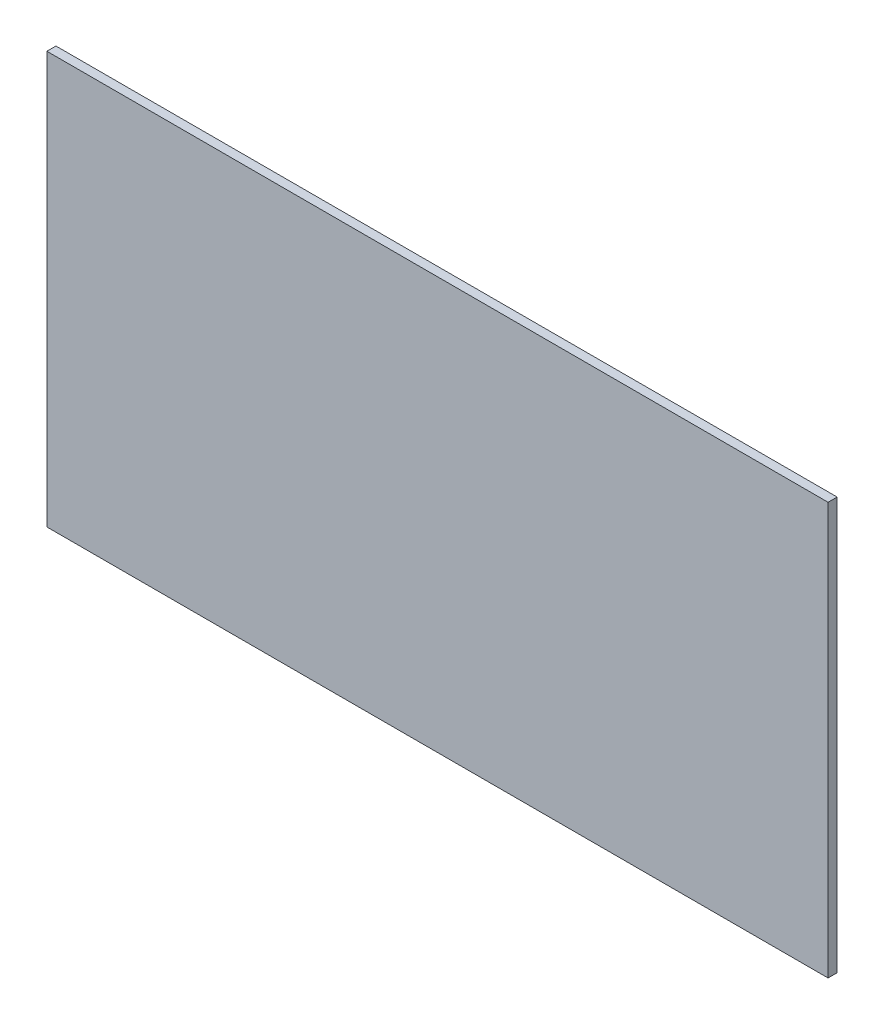
ISO-10303-21;
HEADER;
FILE_DESCRIPTION(('STEP AP214'),'2;1');
FILE_NAME('part.step','',(''),(''),'','','');
FILE_SCHEMA(('AUTOMOTIVE_DESIGN { 1 0 10303 214 1 1 1 1 }'));
ENDSEC;
DATA;
#1=APPLICATION_CONTEXT('core data for automotive mechanical design processes');
#2=APPLICATION_PROTOCOL_DEFINITION('international standard','automotive_design',2000,#1);
#3=PRODUCT_CONTEXT('',#1,'mechanical');
#4=PRODUCT('Part','Part','',(#3));
#5=PRODUCT_RELATED_PRODUCT_CATEGORY('part','',(#4));
#6=PRODUCT_DEFINITION_FORMATION('','',#4);
#7=PRODUCT_DEFINITION_CONTEXT('part definition',#1,'design');
#8=PRODUCT_DEFINITION('design','',#6,#7);
#9=PRODUCT_DEFINITION_SHAPE('','',#8);
#10=(LENGTH_UNIT() NAMED_UNIT(*) SI_UNIT(.MILLI.,.METRE.));
#11=(NAMED_UNIT(*) PLANE_ANGLE_UNIT() SI_UNIT($,.RADIAN.));
#12=(NAMED_UNIT(*) SI_UNIT($,.STERADIAN.) SOLID_ANGLE_UNIT());
#13=UNCERTAINTY_MEASURE_WITH_UNIT(LENGTH_MEASURE(1.E-05),#10,'distance_accuracy_value','');
#14=(GEOMETRIC_REPRESENTATION_CONTEXT(3) GLOBAL_UNCERTAINTY_ASSIGNED_CONTEXT((#13)) GLOBAL_UNIT_ASSIGNED_CONTEXT((#10,
#11,#12)) REPRESENTATION_CONTEXT('',''));
#15=CARTESIAN_POINT('',(0.,0.,0.));
#16=DIRECTION('',(0.,0.,1.));
#17=DIRECTION('',(1.,0.,0.));
#18=AXIS2_PLACEMENT_3D('',#15,#16,#17);
#19=CARTESIAN_POINT('',(0.,0.,-2.65684));
#20=DIRECTION('',(-1.,0.,0.));
#21=DIRECTION('',(0.,0.,1.));
#22=AXIS2_PLACEMENT_3D('',#19,#20,#21);
#23=PLANE('',#22);
#24=DIRECTION('',(0.,-1.,0.));
#25=VECTOR('',#24,1.);
#26=CARTESIAN_POINT('',(0.,0.,0.));
#27=LINE('',#26,#25);
#28=CARTESIAN_POINT('',(0.,120.88368,0.));
#29=VERTEX_POINT('',#28);
#30=CARTESIAN_POINT('',(0.,0.,0.));
#31=VERTEX_POINT('',#30);
#32=EDGE_CURVE('E102',#29,#31,#27,.T.);
#33=ORIENTED_EDGE('',*,*,#32,.F.);
#34=DIRECTION('',(0.,0.,1.));
#35=VECTOR('',#34,1.);
#36=CARTESIAN_POINT('',(0.,120.88368,-2.65684));
#37=LINE('',#36,#35);
#38=CARTESIAN_POINT('',(0.,120.88368,-2.65684));
#39=VERTEX_POINT('',#38);
#40=EDGE_CURVE('E11',#39,#29,#37,.T.);
#41=ORIENTED_EDGE('',*,*,#40,.F.);
#42=DIRECTION('',(0.,-1.,0.));
#43=VECTOR('',#42,1.);
#44=CARTESIAN_POINT('',(0.,0.,-2.65684));
#45=LINE('',#44,#43);
#46=CARTESIAN_POINT('',(0.,0.,-2.65684));
#47=VERTEX_POINT('',#46);
#48=EDGE_CURVE('E96',#39,#47,#45,.T.);
#49=ORIENTED_EDGE('',*,*,#48,.T.);
#50=DIRECTION('',(0.,0.,1.));
#51=VECTOR('',#50,1.);
#52=CARTESIAN_POINT('',(0.,0.,-2.65684));
#53=LINE('',#52,#51);
#54=EDGE_CURVE('E41',#47,#31,#53,.T.);
#55=ORIENTED_EDGE('',*,*,#54,.T.);
#56=EDGE_LOOP('',(#33,#41,#49,#55));
#57=FACE_BOUND('',#56,.T.);
#58=ADVANCED_FACE('F38',(#57),#23,.T.);
#59=CARTESIAN_POINT('',(0.,120.88368,-2.65684));
#60=DIRECTION('',(0.,1.,0.));
#61=DIRECTION('',(0.,0.,1.));
#62=AXIS2_PLACEMENT_3D('',#59,#60,#61);
#63=PLANE('',#62);
#64=DIRECTION('',(-1.,0.,0.));
#65=VECTOR('',#64,1.);
#66=CARTESIAN_POINT('',(0.,120.88368,0.));
#67=LINE('',#66,#65);
#68=CARTESIAN_POINT('',(229.1969,120.88368,0.));
#69=VERTEX_POINT('',#68);
#70=EDGE_CURVE('E98',#69,#29,#67,.T.);
#71=ORIENTED_EDGE('',*,*,#70,.F.);
#72=DIRECTION('',(0.,0.,1.));
#73=VECTOR('',#72,1.);
#74=CARTESIAN_POINT('',(229.1969,120.88368,-2.65684));
#75=LINE('',#74,#73);
#76=CARTESIAN_POINT('',(229.1969,120.88368,-2.65684));
#77=VERTEX_POINT('',#76);
#78=EDGE_CURVE('E47',#77,#69,#75,.T.);
#79=ORIENTED_EDGE('',*,*,#78,.F.);
#80=DIRECTION('',(-1.,0.,0.));
#81=VECTOR('',#80,1.);
#82=CARTESIAN_POINT('',(0.,120.88368,-2.65684));
#83=LINE('',#82,#81);
#84=EDGE_CURVE('E93',#77,#39,#83,.T.);
#85=ORIENTED_EDGE('',*,*,#84,.T.);
#86=ORIENTED_EDGE('',*,*,#40,.T.);
#87=EDGE_LOOP('',(#71,#79,#85,#86));
#88=FACE_BOUND('',#87,.T.);
#89=ADVANCED_FACE('F112',(#88),#63,.T.);
#90=CARTESIAN_POINT('',(229.1969,0.,-2.65684));
#91=DIRECTION('',(1.,0.,0.));
#92=DIRECTION('',(0.,0.,-1.));
#93=AXIS2_PLACEMENT_3D('',#90,#91,#92);
#94=PLANE('',#93);
#95=DIRECTION('',(0.,1.,0.));
#96=VECTOR('',#95,1.);
#97=CARTESIAN_POINT('',(229.1969,0.,0.));
#98=LINE('',#97,#96);
#99=CARTESIAN_POINT('',(229.1969,0.,0.));
#100=VERTEX_POINT('',#99);
#101=EDGE_CURVE('E88',#100,#69,#98,.T.);
#102=ORIENTED_EDGE('',*,*,#101,.F.);
#103=DIRECTION('',(0.,0.,1.));
#104=VECTOR('',#103,1.);
#105=CARTESIAN_POINT('',(229.1969,0.,-2.65684));
#106=LINE('',#105,#104);
#107=CARTESIAN_POINT('',(229.1969,0.,-2.65684));
#108=VERTEX_POINT('',#107);
#109=EDGE_CURVE('E83',#108,#100,#106,.T.);
#110=ORIENTED_EDGE('',*,*,#109,.F.);
#111=DIRECTION('',(0.,1.,0.));
#112=VECTOR('',#111,1.);
#113=CARTESIAN_POINT('',(229.1969,0.,-2.65684));
#114=LINE('',#113,#112);
#115=EDGE_CURVE('E86',#108,#77,#114,.T.);
#116=ORIENTED_EDGE('',*,*,#115,.T.);
#117=ORIENTED_EDGE('',*,*,#78,.T.);
#118=EDGE_LOOP('',(#102,#110,#116,#117));
#119=FACE_BOUND('',#118,.T.);
#120=ADVANCED_FACE('F85',(#119),#94,.T.);
#121=CARTESIAN_POINT('',(0.,0.,-2.65684));
#122=DIRECTION('',(0.,-1.,0.));
#123=DIRECTION('',(0.,0.,-1.));
#124=AXIS2_PLACEMENT_3D('',#121,#122,#123);
#125=PLANE('',#124);
#126=DIRECTION('',(1.,0.,0.));
#127=VECTOR('',#126,1.);
#128=CARTESIAN_POINT('',(0.,0.,0.));
#129=LINE('',#128,#127);
#130=EDGE_CURVE('E105',#31,#100,#129,.T.);
#131=ORIENTED_EDGE('',*,*,#130,.F.);
#132=ORIENTED_EDGE('',*,*,#54,.F.);
#133=DIRECTION('',(1.,0.,0.));
#134=VECTOR('',#133,1.);
#135=CARTESIAN_POINT('',(0.,0.,-2.65684));
#136=LINE('',#135,#134);
#137=EDGE_CURVE('E92',#47,#108,#136,.T.);
#138=ORIENTED_EDGE('',*,*,#137,.T.);
#139=ORIENTED_EDGE('',*,*,#109,.T.);
#140=EDGE_LOOP('',(#131,#132,#138,#139));
#141=FACE_BOUND('',#140,.T.);
#142=ADVANCED_FACE('F95',(#141),#125,.T.);
#143=CARTESIAN_POINT('',(0.,0.,-2.65684));
#144=DIRECTION('',(0.,0.,-1.));
#145=DIRECTION('',(-1.,0.,0.));
#146=AXIS2_PLACEMENT_3D('',#143,#144,#145);
#147=PLANE('',#146);
#148=ORIENTED_EDGE('',*,*,#48,.F.);
#149=ORIENTED_EDGE('',*,*,#84,.F.);
#150=ORIENTED_EDGE('',*,*,#115,.F.);
#151=ORIENTED_EDGE('',*,*,#137,.F.);
#152=EDGE_LOOP('',(#148,#149,#150,#151));
#153=FACE_BOUND('',#152,.T.);
#154=ADVANCED_FACE('F91',(#153),#147,.T.);
#155=CARTESIAN_POINT('',(0.,0.,0.));
#156=DIRECTION('',(0.,0.,-1.));
#157=DIRECTION('',(-1.,0.,0.));
#158=AXIS2_PLACEMENT_3D('',#155,#156,#157);
#159=PLANE('',#158);
#160=ORIENTED_EDGE('',*,*,#32,.T.);
#161=ORIENTED_EDGE('',*,*,#130,.T.);
#162=ORIENTED_EDGE('',*,*,#101,.T.);
#163=ORIENTED_EDGE('',*,*,#70,.T.);
#164=EDGE_LOOP('',(#160,#161,#162,#163));
#165=FACE_BOUND('',#164,.T.);
#166=ADVANCED_FACE('F111',(#165),#159,.F.);
#167=CLOSED_SHELL('',(#58,#89,#120,#142,#154,#166));
#168=MANIFOLD_SOLID_BREP('B2',#167);
#169=ADVANCED_BREP_SHAPE_REPRESENTATION('',(#18,#168),#14);
#170=SHAPE_DEFINITION_REPRESENTATION(#9,#169);
ENDSEC;
END-ISO-10303-21;
